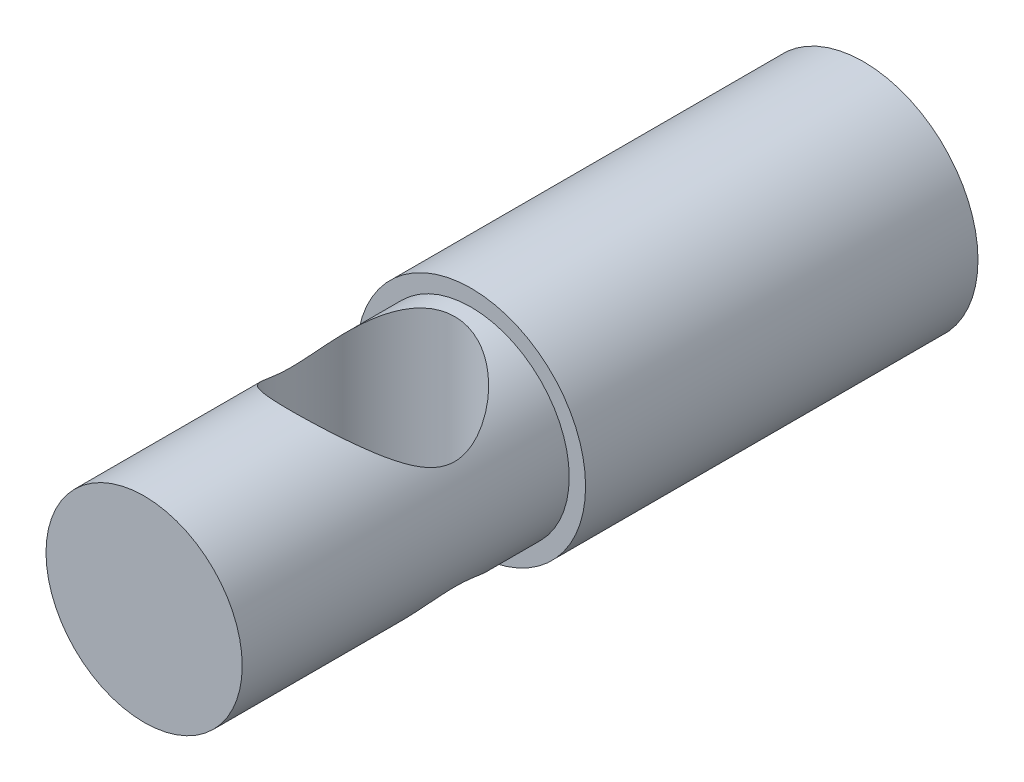
ISO-10303-21;
HEADER;
FILE_DESCRIPTION(('STEP AP214'),'2;1');
FILE_NAME('part.step','',(''),(''),'','','');
FILE_SCHEMA(('AUTOMOTIVE_DESIGN { 1 0 10303 214 1 1 1 1 }'));
ENDSEC;
DATA;
#1=APPLICATION_CONTEXT('core data for automotive mechanical design processes');
#2=APPLICATION_PROTOCOL_DEFINITION('international standard','automotive_design',2000,#1);
#3=PRODUCT_CONTEXT('',#1,'mechanical');
#4=PRODUCT('Part','Part','',(#3));
#5=PRODUCT_RELATED_PRODUCT_CATEGORY('part','',(#4));
#6=PRODUCT_DEFINITION_FORMATION('','',#4);
#7=PRODUCT_DEFINITION_CONTEXT('part definition',#1,'design');
#8=PRODUCT_DEFINITION('design','',#6,#7);
#9=PRODUCT_DEFINITION_SHAPE('','',#8);
#10=(LENGTH_UNIT() NAMED_UNIT(*) SI_UNIT(.MILLI.,.METRE.));
#11=(NAMED_UNIT(*) PLANE_ANGLE_UNIT() SI_UNIT($,.RADIAN.));
#12=(NAMED_UNIT(*) SI_UNIT($,.STERADIAN.) SOLID_ANGLE_UNIT());
#13=UNCERTAINTY_MEASURE_WITH_UNIT(LENGTH_MEASURE(1.E-05),#10,'distance_accuracy_value','');
#14=(GEOMETRIC_REPRESENTATION_CONTEXT(3) GLOBAL_UNCERTAINTY_ASSIGNED_CONTEXT((#13)) GLOBAL_UNIT_ASSIGNED_CONTEXT((#10,
#11,#12)) REPRESENTATION_CONTEXT('',''));
#15=CARTESIAN_POINT('',(0.,0.,0.));
#16=DIRECTION('',(0.,0.,1.));
#17=DIRECTION('',(1.,0.,0.));
#18=AXIS2_PLACEMENT_3D('',#15,#16,#17);
#19=CARTESIAN_POINT('',(0.,0.,11.));
#20=DIRECTION('',(0.,0.,1.));
#21=DIRECTION('',(1.,0.,0.));
#22=AXIS2_PLACEMENT_3D('',#19,#20,#21);
#23=CYLINDRICAL_SURFACE('',#22,3.);
#24=CARTESIAN_POINT('',(0.,0.,21.));
#25=DIRECTION('',(0.,0.,1.));
#26=DIRECTION('',(1.,0.,0.));
#27=AXIS2_PLACEMENT_3D('',#24,#25,#26);
#28=CIRCLE('',#27,3.);
#29=CARTESIAN_POINT('',(3.,0.,21.));
#30=VERTEX_POINT('',#29);
#31=EDGE_CURVE('E64',#30,#30,#28,.T.);
#32=ORIENTED_EDGE('',*,*,#31,.F.);
#33=EDGE_LOOP('',(#32));
#34=FACE_BOUND('',#33,.T.);
#35=CARTESIAN_POINT('',(0.,0.,11.));
#36=DIRECTION('',(0.,0.,1.));
#37=DIRECTION('',(1.,0.,0.));
#38=AXIS2_PLACEMENT_3D('',#35,#36,#37);
#39=CIRCLE('',#38,3.);
#40=CARTESIAN_POINT('',(3.,0.,11.));
#41=VERTEX_POINT('',#40);
#42=EDGE_CURVE('E59',#41,#41,#39,.T.);
#43=ORIENTED_EDGE('',*,*,#42,.T.);
#44=EDGE_LOOP('',(#43));
#45=FACE_BOUND('',#44,.T.);
#46=CARTESIAN_POINT('',(0.,-3.,16.5));
#47=CARTESIAN_POINT('',(-0.118757533193203,-2.99999522795205,16.4999951144463));
#48=CARTESIAN_POINT('',(-0.237551281104127,-2.99288670594742,16.4914774960954));
#49=CARTESIAN_POINT('',(-0.47118249249281,-2.96510762868268,16.4580372766482));
#50=CARTESIAN_POINT('',(-0.586016959612417,-2.94442702942008,16.4331025260247));
#51=CARTESIAN_POINT('',(-0.807829942407297,-2.89142690238865,16.3686878826673));
#52=CARTESIAN_POINT('',(-0.914850920904901,-2.8591769655007,16.3292949256463));
#53=CARTESIAN_POINT('',(-1.11984139043408,-2.78529176182903,16.2379829520574));
#54=CARTESIAN_POINT('',(-1.21780780775233,-2.74365332434937,16.1860597033268));
#55=CARTESIAN_POINT('',(-1.43789998519767,-2.63674191529867,16.0505462501919));
#56=CARTESIAN_POINT('',(-1.5556821965722,-2.56840549256191,15.9623297958178));
#57=CARTESIAN_POINT('',(-1.77202398328146,-2.42422624777674,15.7694756742486));
#58=CARTESIAN_POINT('',(-1.87052845158605,-2.34836281453276,15.6647924307569));
#59=CARTESIAN_POINT('',(-2.00437263805588,-2.23294886313738,15.4959157235089));
#60=CARTESIAN_POINT('',(-2.04699726278816,-2.19383679994997,15.4370444238087));
#61=CARTESIAN_POINT('',(-2.12715295529554,-2.11620611809194,15.3154943970395));
#62=CARTESIAN_POINT('',(-2.16468231743739,-2.07768770195023,15.2528144051293));
#63=CARTESIAN_POINT('',(-2.23441122570746,-2.00250543288661,15.1237326756644));
#64=CARTESIAN_POINT('',(-2.26662332666227,-1.96583735754651,15.0573402152752));
#65=CARTESIAN_POINT('',(-2.32553690612792,-1.89577686630311,14.9205537160716));
#66=CARTESIAN_POINT('',(-2.3522430799868,-1.86238167220904,14.8501631526582));
#67=CARTESIAN_POINT('',(-2.40193513934005,-1.79791918980412,14.6983329097999));
#68=CARTESIAN_POINT('',(-2.42433807692598,-1.76736311251003,14.6164759072765));
#69=CARTESIAN_POINT('',(-2.46101313675502,-1.71593180556004,14.4481102311869));
#70=CARTESIAN_POINT('',(-2.47530499393792,-1.69503310194197,14.3616134133853));
#71=CARTESIAN_POINT('',(-2.49481072799048,-1.66620928968844,14.1842345916205));
#72=CARTESIAN_POINT('',(-2.49991205058667,-1.65844510563093,14.0933120409293));
#73=CARTESIAN_POINT('',(-2.5000856937119,-1.65818308531825,13.9114373869972));
#74=CARTESIAN_POINT('',(-2.49515788278405,-1.6656854491694,13.8204852833847));
#75=CARTESIAN_POINT('',(-2.47505262029594,-1.69541639464497,13.6344752891729));
#76=CARTESIAN_POINT('',(-2.45905577113332,-1.71881932066467,13.5397062542829));
#77=CARTESIAN_POINT('',(-2.41742550503027,-1.77688235738914,13.3557890187978));
#78=CARTESIAN_POINT('',(-2.3917601104429,-1.81157977103024,13.2666606292852));
#79=CARTESIAN_POINT('',(-2.33816270346873,-1.88002226126137,13.1121729214589));
#80=CARTESIAN_POINT('',(-2.31177513033566,-1.91250316845439,13.0456877575884));
#81=CARTESIAN_POINT('',(-2.25404424958636,-1.98021996661529,12.9163491932201));
#82=CARTESIAN_POINT('',(-2.22269803586306,-2.01545746697785,12.8534979521342));
#83=CARTESIAN_POINT('',(-2.12149677560466,-2.12342648109724,12.6700331589803));
#84=CARTESIAN_POINT('',(-2.04450664231777,-2.19837696967438,12.5545858523939));
#85=CARTESIAN_POINT('',(-1.86765914501415,-2.35079897952277,12.3317330375457));
#86=CARTESIAN_POINT('',(-1.76681805277629,-2.42819792618944,12.2250616760081));
#87=CARTESIAN_POINT('',(-1.54484388336149,-2.57509054043285,12.0288876551826));
#88=CARTESIAN_POINT('',(-1.42375565615774,-2.64460112267364,11.9393479669437));
#89=CARTESIAN_POINT('',(-1.19411179169416,-2.75428914126547,11.8005851609015));
#90=CARTESIAN_POINT('',(-1.08972732107277,-2.79748350073995,11.7468571018124));
#91=CARTESIAN_POINT('',(-0.871071458330372,-2.87307804019801,11.6536572547447));
#92=CARTESIAN_POINT('',(-0.756806292780768,-2.90548495660805,11.6141765684194));
#93=CARTESIAN_POINT('',(-0.519954301215424,-2.95709834265565,11.5515827500678));
#94=CARTESIAN_POINT('',(-0.397310923125313,-2.97620280955844,11.5285960533424));
#95=CARTESIAN_POINT('',(-0.148559976923732,-2.99891434528972,11.5012907680728));
#96=CARTESIAN_POINT('',(-0.0224547835240061,-3.00253178304177,11.4969596891498));
#97=CARTESIAN_POINT('',(0.213310199456571,-2.99444999039147,11.5066624394438));
#98=CARTESIAN_POINT('',(0.323130540835856,-2.98453350716313,11.5185586387152));
#99=CARTESIAN_POINT('',(0.538644964400602,-2.95325589460136,11.5562669502115));
#100=CARTESIAN_POINT('',(0.644338549989559,-2.93189339242796,11.582080731719));
#101=CARTESIAN_POINT('',(0.850565499199253,-2.87889521546186,11.6466233954553));
#102=CARTESIAN_POINT('',(0.951010682223313,-2.84712564891974,11.6855207894443));
#103=CARTESIAN_POINT('',(1.14365900898103,-2.7753612473389,11.7743956323367));
#104=CARTESIAN_POINT('',(1.2358590883121,-2.73536337221808,11.8243771769933));
#105=CARTESIAN_POINT('',(1.45067439735099,-2.62975152158594,11.958431795347));
#106=CARTESIAN_POINT('',(1.5683435954073,-2.56070244234714,12.0477325832673));
#107=CARTESIAN_POINT('',(1.78428994740847,-2.41522445403191,12.2428403826556));
#108=CARTESIAN_POINT('',(1.88250490855173,-2.33877300422835,12.3486984553547));
#109=CARTESIAN_POINT('',(2.01573314784291,-2.22269805598601,12.5194119679286));
#110=CARTESIAN_POINT('',(2.05811069143949,-2.1834115173603,12.578898272976));
#111=CARTESIAN_POINT('',(2.13771669597406,-2.10553153817181,12.7017208160323));
#112=CARTESIAN_POINT('',(2.17494330406755,-2.06693835133607,12.7650584276641));
#113=CARTESIAN_POINT('',(2.24398857026757,-1.9917610848264,12.8954884039152));
#114=CARTESIAN_POINT('',(2.27582148781538,-1.95517188634212,12.9625702245336));
#115=CARTESIAN_POINT('',(2.3338885673946,-1.88547561448179,13.1007901044998));
#116=CARTESIAN_POINT('',(2.36012785984655,-1.85236536450791,13.1719243704194));
#117=CARTESIAN_POINT('',(2.40837357148322,-1.78925557416047,13.3242703683519));
#118=CARTESIAN_POINT('',(2.42988314318544,-1.75970711786654,13.4058344510737));
#119=CARTESIAN_POINT('',(2.46482255689514,-1.71043063887427,13.5734519539426));
#120=CARTESIAN_POINT('',(2.47827257713357,-1.69067811225259,13.6594935713279));
#121=CARTESIAN_POINT('',(2.49617289535263,-1.6641531597946,13.8356376074123));
#122=CARTESIAN_POINT('',(2.5005179918396,-1.65753251048391,13.9257753297507));
#123=CARTESIAN_POINT('',(2.49938197104456,-1.65924308630667,14.1058532127839));
#124=CARTESIAN_POINT('',(2.49389826274012,-1.66757825402155,14.1957933151251));
#125=CARTESIAN_POINT('',(2.47265263848541,-1.69892898735519,14.3816725753905));
#126=CARTESIAN_POINT('',(2.45585812550761,-1.72341371023858,14.4772302705327));
#127=CARTESIAN_POINT('',(2.41250339675092,-1.78358728037387,14.6625312960827));
#128=CARTESIAN_POINT('',(2.38591088285909,-1.81931312531326,14.7522542287093));
#129=CARTESIAN_POINT('',(2.33050835844919,-1.88952619366193,14.9077890413548));
#130=CARTESIAN_POINT('',(2.30325853049532,-1.9227781662779,14.9747437592349));
#131=CARTESIAN_POINT('',(2.24370627018013,-1.9919518523057,15.1049463864244));
#132=CARTESIAN_POINT('',(2.21140090020864,-2.02787511150519,15.1681921109998));
#133=CARTESIAN_POINT('',(2.10716294428986,-2.13775931167912,15.352729561342));
#134=CARTESIAN_POINT('',(2.02793576743752,-2.21379780164319,15.4687469249919));
#135=CARTESIAN_POINT('',(1.84629697567415,-2.36772603763546,15.6920072612912));
#136=CARTESIAN_POINT('',(1.74293959593281,-2.44552394429512,15.7985417940329));
#137=CARTESIAN_POINT('',(1.51553554935622,-2.59256498427754,15.9938637995393));
#138=CARTESIAN_POINT('',(1.39153583663216,-2.66182692543067,16.0826905658739));
#139=CARTESIAN_POINT('',(1.15855518141085,-2.76942305781508,16.2183141967231));
#140=CARTESIAN_POINT('',(1.05399877947695,-2.81112174006882,16.2700385102194));
#141=CARTESIAN_POINT('',(0.835439786054371,-2.88361460666452,16.3592186702386));
#142=CARTESIAN_POINT('',(0.721450026753917,-2.9144233132377,16.3966935240953));
#143=CARTESIAN_POINT('',(0.506620038886868,-2.9585874590469,16.4501884558266));
#144=CARTESIAN_POINT('',(0.406845468761932,-2.97402142398111,16.4687751222268));
#145=CARTESIAN_POINT('',(0.204722725654241,-2.99472922794408,16.4936823682381));
#146=CARTESIAN_POINT('',(0.102374818922786,-3.00000411373941,16.5000042115869));
#147=CARTESIAN_POINT('',(0.,-3.,16.5));
#148=B_SPLINE_CURVE_WITH_KNOTS('',3,(#46,#47,#48,#49,#50,#51,#52,#53,#54,#55,#56,#57,#58,#59,
#60,#61,#62,#63,#64,#65,#66,#67,#68,#69,#70,#71,#72,#73,#74,#75,#76,#77,#78,#79,#80,#81,#82,#83,
#84,#85,#86,#87,#88,#89,#90,#91,#92,#93,#94,#95,#96,#97,#98,#99,#100,#101,#102,#103,#104,#105,
#106,#107,#108,#109,#110,#111,#112,#113,#114,#115,#116,#117,#118,#119,#120,#121,#122,#123,#124,
#125,#126,#127,#128,#129,#130,#131,#132,#133,#134,#135,#136,#137,#138,#139,#140,#141,#142,#143,
#144,#145,#146,#147),.UNSPECIFIED.,.T.,.F.,(4,2,2,2,2,2,2,2,2,2,2,2,2,2,2,2,2,2,2,2,2,2,2,2,2,2,
2,2,2,2,2,2,2,2,2,2,2,2,2,2,2,2,2,2,2,2,2,2,2,2,4),(0.,0.355841276815113,0.711946191026961,
1.06594405359551,1.42006164830116,1.90425178760126,2.38980643116775,2.63722280423449,
2.88472179650724,3.13162777943676,3.37832232674674,3.64812890035755,3.91727616616869,
4.18969776924975,4.46212294312047,4.75723524199722,5.05333228584568,5.28870178855694,
5.52420974868633,5.9954933935898,6.49137310548271,6.98616858956867,7.36002155957575,
7.73364063000475,8.11009395319721,8.4862951927436,8.81743460677926,9.14861374669872,
9.48423297747606,9.81997643164433,10.3065635514456,10.7946819775667,11.0432812121088,
11.2919696391639,11.5399899810636,11.787781852862,12.0551105531685,12.3217671309317,
12.5914881373799,12.8612802568452,13.1598101383752,13.4593330283462,13.6977271411687,
13.9362602949129,14.4135864576438,14.914300110886,15.413889999571,15.7841228897598,
16.1538601797496,16.4606444271243,16.7673970625124),.UNSPECIFIED.);
#149=CARTESIAN_POINT('',(0.,-3.,16.5));
#150=VERTEX_POINT('',#149);
#151=EDGE_CURVE('E67',#150,#150,#148,.T.);
#152=ORIENTED_EDGE('',*,*,#151,.F.);
#153=EDGE_LOOP('',(#152));
#154=FACE_BOUND('',#153,.T.);
#155=CARTESIAN_POINT('',(0.,3.,11.5));
#156=CARTESIAN_POINT('',(0.118757533193204,2.99999522795205,11.5000048855537));
#157=CARTESIAN_POINT('',(0.237551281104128,2.99288670594742,11.5085225039046));
#158=CARTESIAN_POINT('',(0.471182492492811,2.96510762868268,11.5419627233518));
#159=CARTESIAN_POINT('',(0.586016959612418,2.94442702942007,11.5668974739753));
#160=CARTESIAN_POINT('',(0.807829942407297,2.89142690238865,11.6313121173327));
#161=CARTESIAN_POINT('',(0.914850920904901,2.8591769655007,11.6707050743537));
#162=CARTESIAN_POINT('',(1.11984139043408,2.78529176182903,11.7620170479426));
#163=CARTESIAN_POINT('',(1.21780780775233,2.74365332434937,11.8139402966733));
#164=CARTESIAN_POINT('',(1.43789998519767,2.63674191529867,11.9494537498082));
#165=CARTESIAN_POINT('',(1.5556821965722,2.56840549256191,12.0376702041822));
#166=CARTESIAN_POINT('',(1.77202398328147,2.42422624777674,12.2305243257514));
#167=CARTESIAN_POINT('',(1.87052845158605,2.34836281453276,12.3352075692431));
#168=CARTESIAN_POINT('',(2.00437263805589,2.23294886313738,12.5040842764911));
#169=CARTESIAN_POINT('',(2.04699726278816,2.19383679994997,12.5629555761913));
#170=CARTESIAN_POINT('',(2.12715295529554,2.11620611809193,12.6845056029605));
#171=CARTESIAN_POINT('',(2.16468231743739,2.07768770195023,12.7471855948707));
#172=CARTESIAN_POINT('',(2.23441122570746,2.00250543288661,12.8762673243356));
#173=CARTESIAN_POINT('',(2.26662332666227,1.96583735754651,12.9426597847248));
#174=CARTESIAN_POINT('',(2.32553690612792,1.89577686630311,13.0794462839284));
#175=CARTESIAN_POINT('',(2.3522430799868,1.86238167220904,13.1498368473418));
#176=CARTESIAN_POINT('',(2.40193513934005,1.79791918980412,13.3016670902001));
#177=CARTESIAN_POINT('',(2.42433807692598,1.76736311251003,13.3835240927235));
#178=CARTESIAN_POINT('',(2.46101313675502,1.71593180556003,13.5518897688131));
#179=CARTESIAN_POINT('',(2.47530499393792,1.69503310194197,13.6383865866147));
#180=CARTESIAN_POINT('',(2.49481072799048,1.66620928968844,13.8157654083795));
#181=CARTESIAN_POINT('',(2.49991205058667,1.65844510563093,13.9066879590707));
#182=CARTESIAN_POINT('',(2.5000856937119,1.65818308531825,14.0885626130028));
#183=CARTESIAN_POINT('',(2.49515788278405,1.6656854491694,14.1795147166153));
#184=CARTESIAN_POINT('',(2.47505262029594,1.69541639464497,14.3655247108271));
#185=CARTESIAN_POINT('',(2.45905577113332,1.71881932066467,14.4602937457171));
#186=CARTESIAN_POINT('',(2.41742550503027,1.77688235738914,14.6442109812022));
#187=CARTESIAN_POINT('',(2.3917601104429,1.81157977103024,14.7333393707148));
#188=CARTESIAN_POINT('',(2.33816270346873,1.88002226126137,14.8878270785411));
#189=CARTESIAN_POINT('',(2.31177513033566,1.91250316845439,14.9543122424116));
#190=CARTESIAN_POINT('',(2.25404424958636,1.98021996661529,15.0836508067799));
#191=CARTESIAN_POINT('',(2.22269803586306,2.01545746697785,15.1465020478658));
#192=CARTESIAN_POINT('',(2.12149677560466,2.12342648109724,15.3299668410197));
#193=CARTESIAN_POINT('',(2.04450664231777,2.19837696967438,15.4454141476061));
#194=CARTESIAN_POINT('',(1.86765914501415,2.35079897952277,15.6682669624543));
#195=CARTESIAN_POINT('',(1.76681805277629,2.42819792618944,15.7749383239919));
#196=CARTESIAN_POINT('',(1.54484388336149,2.57509054043285,15.9711123448174));
#197=CARTESIAN_POINT('',(1.42375565615774,2.64460112267364,16.0606520330563));
#198=CARTESIAN_POINT('',(1.19411179169416,2.75428914126547,16.1994148390986));
#199=CARTESIAN_POINT('',(1.08972732107278,2.79748350073995,16.2531428981877));
#200=CARTESIAN_POINT('',(0.871071458330374,2.87307804019801,16.3463427452553));
#201=CARTESIAN_POINT('',(0.756806292780771,2.90548495660805,16.3858234315806));
#202=CARTESIAN_POINT('',(0.519954301215426,2.95709834265565,16.4484172499322));
#203=CARTESIAN_POINT('',(0.397310923125316,2.97620280955844,16.4714039466576));
#204=CARTESIAN_POINT('',(0.148559976923734,2.99891434528972,16.4987092319272));
#205=CARTESIAN_POINT('',(0.0224547835240093,3.00253178304177,16.5030403108502));
#206=CARTESIAN_POINT('',(-0.213310199456568,2.99444999039147,16.4933375605562));
#207=CARTESIAN_POINT('',(-0.323130540835852,2.98453350716313,16.4814413612848));
#208=CARTESIAN_POINT('',(-0.538644964400598,2.95325589460136,16.4437330497885));
#209=CARTESIAN_POINT('',(-0.644338549989555,2.93189339242796,16.417919268281));
#210=CARTESIAN_POINT('',(-0.850565499199249,2.87889521546186,16.3533766045447));
#211=CARTESIAN_POINT('',(-0.951010682223308,2.84712564891975,16.3144792105557));
#212=CARTESIAN_POINT('',(-1.14365900898103,2.7753612473389,16.2256043676633));
#213=CARTESIAN_POINT('',(-1.23585908831209,2.73536337221809,16.1756228230067));
#214=CARTESIAN_POINT('',(-1.45067439735099,2.62975152158594,16.041568204653));
#215=CARTESIAN_POINT('',(-1.5683435954073,2.56070244234715,15.9522674167327));
#216=CARTESIAN_POINT('',(-1.78428994740847,2.41522445403191,15.7571596173444));
#217=CARTESIAN_POINT('',(-1.88250490855172,2.33877300422835,15.6513015446453));
#218=CARTESIAN_POINT('',(-2.0157331478429,2.22269805598601,15.4805880320714));
#219=CARTESIAN_POINT('',(-2.05811069143948,2.1834115173603,15.421101727024));
#220=CARTESIAN_POINT('',(-2.13771669597406,2.10553153817182,15.2982791839677));
#221=CARTESIAN_POINT('',(-2.17494330406754,2.06693835133607,15.2349415723359));
#222=CARTESIAN_POINT('',(-2.24398857026757,1.9917610848264,15.1045115960848));
#223=CARTESIAN_POINT('',(-2.27582148781537,1.95517188634212,15.0374297754664));
#224=CARTESIAN_POINT('',(-2.33388856739459,1.88547561448179,14.8992098955002));
#225=CARTESIAN_POINT('',(-2.36012785984655,1.85236536450791,14.8280756295806));
#226=CARTESIAN_POINT('',(-2.40837357148322,1.78925557416048,14.6757296316481));
#227=CARTESIAN_POINT('',(-2.42988314318544,1.75970711786654,14.5941655489263));
#228=CARTESIAN_POINT('',(-2.46482255689514,1.71043063887427,14.4265480460574));
#229=CARTESIAN_POINT('',(-2.47827257713357,1.69067811225259,14.3405064286721));
#230=CARTESIAN_POINT('',(-2.49617289535263,1.6641531597946,14.1643623925877));
#231=CARTESIAN_POINT('',(-2.5005179918396,1.65753251048391,14.0742246702493));
#232=CARTESIAN_POINT('',(-2.49938197104456,1.65924308630667,13.8941467872161));
#233=CARTESIAN_POINT('',(-2.49389826274012,1.66757825402155,13.8042066848749));
#234=CARTESIAN_POINT('',(-2.47265263848541,1.69892898735519,13.6183274246095));
#235=CARTESIAN_POINT('',(-2.45585812550761,1.72341371023858,13.5227697294673));
#236=CARTESIAN_POINT('',(-2.41250339675092,1.78358728037387,13.3374687039173));
#237=CARTESIAN_POINT('',(-2.38591088285909,1.81931312531326,13.2477457712907));
#238=CARTESIAN_POINT('',(-2.33050835844919,1.88952619366193,13.0922109586452));
#239=CARTESIAN_POINT('',(-2.30325853049532,1.9227781662779,13.0252562407651));
#240=CARTESIAN_POINT('',(-2.24370627018013,1.9919518523057,12.8950536135756));
#241=CARTESIAN_POINT('',(-2.21140090020865,2.02787511150519,12.8318078890002));
#242=CARTESIAN_POINT('',(-2.10716294428986,2.13775931167912,12.6472704386581));
#243=CARTESIAN_POINT('',(-2.02793576743752,2.21379780164319,12.5312530750081));
#244=CARTESIAN_POINT('',(-1.84629697567415,2.36772603763545,12.3079927387088));
#245=CARTESIAN_POINT('',(-1.74293959593282,2.44552394429511,12.2014582059671));
#246=CARTESIAN_POINT('',(-1.51553554935623,2.59256498427754,12.0061362004607));
#247=CARTESIAN_POINT('',(-1.39153583663217,2.66182692543067,11.9173094341261));
#248=CARTESIAN_POINT('',(-1.15855518141085,2.76942305781508,11.7816858032769));
#249=CARTESIAN_POINT('',(-1.05399877947695,2.81112174006882,11.7299614897806));
#250=CARTESIAN_POINT('',(-0.835439786054378,2.88361460666452,11.6407813297614));
#251=CARTESIAN_POINT('',(-0.721450026753924,2.91442331323769,11.6033064759047));
#252=CARTESIAN_POINT('',(-0.506620038886875,2.9585874590469,11.5498115441734));
#253=CARTESIAN_POINT('',(-0.406845468761937,2.9740214239811,11.5312248777732));
#254=CARTESIAN_POINT('',(-0.204722725654243,2.99472922794408,11.5063176317619));
#255=CARTESIAN_POINT('',(-0.102374818922787,3.00000411373941,11.4999957884131));
#256=CARTESIAN_POINT('',(0.,3.,11.5));
#257=B_SPLINE_CURVE_WITH_KNOTS('',3,(#155,#156,#157,#158,#159,#160,#161,#162,#163,#164,#165,
#166,#167,#168,#169,#170,#171,#172,#173,#174,#175,#176,#177,#178,#179,#180,#181,#182,#183,#184,
#185,#186,#187,#188,#189,#190,#191,#192,#193,#194,#195,#196,#197,#198,#199,#200,#201,#202,#203,
#204,#205,#206,#207,#208,#209,#210,#211,#212,#213,#214,#215,#216,#217,#218,#219,#220,#221,#222,
#223,#224,#225,#226,#227,#228,#229,#230,#231,#232,#233,#234,#235,#236,#237,#238,#239,#240,#241,
#242,#243,#244,#245,#246,#247,#248,#249,#250,#251,#252,#253,#254,#255,#256),.UNSPECIFIED.,.T.,
.F.,(4,2,2,2,2,2,2,2,2,2,2,2,2,2,2,2,2,2,2,2,2,2,2,2,2,2,2,2,2,2,2,2,2,2,2,2,2,2,2,2,2,2,2,2,2,
2,2,2,2,2,4),(0.,0.355841276815113,0.711946191026961,1.06594405359551,1.42006164830116,
1.90425178760126,2.38980643116775,2.63722280423449,2.88472179650724,3.13162777943676,
3.37832232674674,3.64812890035755,3.91727616616869,4.18969776924975,4.46212294312047,
4.75723524199722,5.05333228584568,5.28870178855694,5.52420974868633,5.9954933935898,
6.49137310548271,6.98616858956867,7.36002155957575,7.73364063000475,8.11009395319721,
8.4862951927436,8.81743460677926,9.14861374669871,9.48423297747606,9.81997643164433,
10.3065635514456,10.7946819775667,11.0432812121088,11.2919696391639,11.5399899810636,
11.787781852862,12.0551105531685,12.3217671309317,12.5914881373799,12.8612802568452,
13.1598101383752,13.4593330283461,13.6977271411687,13.9362602949129,14.4135864576438,
14.914300110886,15.413889999571,15.7841228897598,16.1538601797496,16.4606444271243,
16.7673970625124),.UNSPECIFIED.);
#258=CARTESIAN_POINT('',(0.,3.,11.5));
#259=VERTEX_POINT('',#258);
#260=EDGE_CURVE('E50',#259,#259,#257,.T.);
#261=ORIENTED_EDGE('',*,*,#260,.T.);
#262=EDGE_LOOP('',(#261));
#263=FACE_BOUND('',#262,.T.);
#264=ADVANCED_FACE('F46',(#34,#45,#154,#263),#23,.T.);
#265=CARTESIAN_POINT('',(0.,0.,21.));
#266=DIRECTION('',(0.,0.,-1.));
#267=DIRECTION('',(-1.,0.,0.));
#268=AXIS2_PLACEMENT_3D('',#265,#266,#267);
#269=CYLINDRICAL_SURFACE('',#268,3.5);
#270=CARTESIAN_POINT('',(0.,0.,11.));
#271=DIRECTION('',(0.,0.,1.));
#272=DIRECTION('',(1.,0.,0.));
#273=AXIS2_PLACEMENT_3D('',#270,#271,#272);
#274=CIRCLE('',#273,3.5);
#275=CARTESIAN_POINT('',(3.5,0.,11.));
#276=VERTEX_POINT('',#275);
#277=EDGE_CURVE('E12',#276,#276,#274,.T.);
#278=ORIENTED_EDGE('',*,*,#277,.F.);
#279=EDGE_LOOP('',(#278));
#280=FACE_BOUND('',#279,.T.);
#281=CARTESIAN_POINT('',(0.,0.,-1.));
#282=DIRECTION('',(0.,0.,-1.));
#283=DIRECTION('',(-1.,0.,0.));
#284=AXIS2_PLACEMENT_3D('',#281,#282,#283);
#285=CIRCLE('',#284,3.5);
#286=CARTESIAN_POINT('',(-3.5,0.,-1.));
#287=VERTEX_POINT('',#286);
#288=EDGE_CURVE('E105',#287,#287,#285,.T.);
#289=ORIENTED_EDGE('',*,*,#288,.F.);
#290=EDGE_LOOP('',(#289));
#291=FACE_BOUND('',#290,.T.);
#292=ADVANCED_FACE('F48',(#280,#291),#269,.T.);
#293=CARTESIAN_POINT('',(0.,0.,11.));
#294=DIRECTION('',(0.,0.,1.));
#295=DIRECTION('',(1.,0.,0.));
#296=AXIS2_PLACEMENT_3D('',#293,#294,#295);
#297=PLANE('',#296);
#298=ORIENTED_EDGE('',*,*,#42,.F.);
#299=EDGE_LOOP('',(#298));
#300=FACE_BOUND('',#299,.T.);
#301=ORIENTED_EDGE('',*,*,#277,.T.);
#302=EDGE_LOOP('',(#301));
#303=FACE_BOUND('',#302,.T.);
#304=ADVANCED_FACE('F93',(#300,#303),#297,.T.);
#305=CARTESIAN_POINT('',(0.,0.,21.));
#306=DIRECTION('',(0.,0.,1.));
#307=DIRECTION('',(1.,0.,0.));
#308=AXIS2_PLACEMENT_3D('',#305,#306,#307);
#309=PLANE('',#308);
#310=ORIENTED_EDGE('',*,*,#31,.T.);
#311=EDGE_LOOP('',(#310));
#312=FACE_BOUND('',#311,.T.);
#313=ADVANCED_FACE('F79',(#312),#309,.T.);
#314=CARTESIAN_POINT('',(0.,-10.,14.));
#315=DIRECTION('',(0.,1.,0.));
#316=DIRECTION('',(0.,0.,1.));
#317=AXIS2_PLACEMENT_3D('',#314,#315,#316);
#318=CYLINDRICAL_SURFACE('',#317,2.5);
#319=ORIENTED_EDGE('',*,*,#151,.T.);
#320=EDGE_LOOP('',(#319));
#321=FACE_BOUND('',#320,.T.);
#322=ORIENTED_EDGE('',*,*,#260,.F.);
#323=EDGE_LOOP('',(#322));
#324=FACE_BOUND('',#323,.T.);
#325=ADVANCED_FACE('F75',(#321,#324),#318,.F.);
#326=CARTESIAN_POINT('',(0.,0.,-1.));
#327=DIRECTION('',(0.,0.,-1.));
#328=DIRECTION('',(-1.,0.,0.));
#329=AXIS2_PLACEMENT_3D('',#326,#327,#328);
#330=PLANE('',#329);
#331=ORIENTED_EDGE('',*,*,#288,.T.);
#332=EDGE_LOOP('',(#331));
#333=FACE_BOUND('',#332,.T.);
#334=ADVANCED_FACE('F78',(#333),#330,.T.);
#335=CLOSED_SHELL('',(#264,#292,#304,#313,#325,#334));
#336=MANIFOLD_SOLID_BREP('B2',#335);
#337=ADVANCED_BREP_SHAPE_REPRESENTATION('',(#18,#336),#14);
#338=SHAPE_DEFINITION_REPRESENTATION(#9,#337);
ENDSEC;
END-ISO-10303-21;
